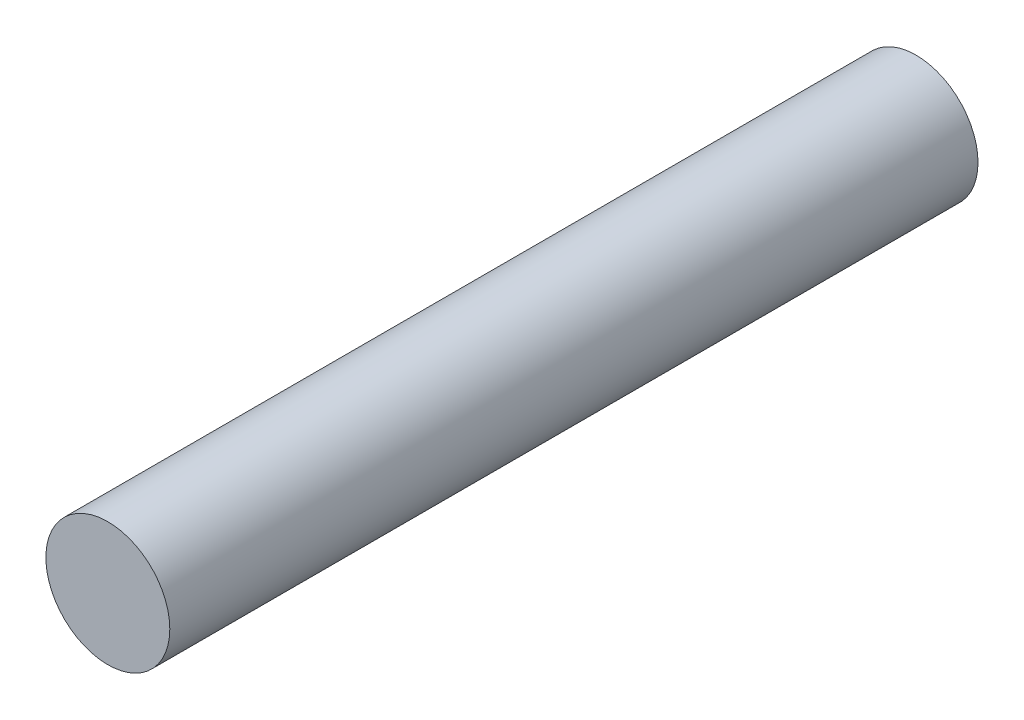
ISO-10303-21;
HEADER;
FILE_DESCRIPTION(('STEP AP214'),'2;1');
FILE_NAME('part.step','',(''),(''),'','','');
FILE_SCHEMA(('AUTOMOTIVE_DESIGN { 1 0 10303 214 1 1 1 1 }'));
ENDSEC;
DATA;
#1=APPLICATION_CONTEXT('core data for automotive mechanical design processes');
#2=APPLICATION_PROTOCOL_DEFINITION('international standard','automotive_design',2000,#1);
#3=PRODUCT_CONTEXT('',#1,'mechanical');
#4=PRODUCT('Part','Part','',(#3));
#5=PRODUCT_RELATED_PRODUCT_CATEGORY('part','',(#4));
#6=PRODUCT_DEFINITION_FORMATION('','',#4);
#7=PRODUCT_DEFINITION_CONTEXT('part definition',#1,'design');
#8=PRODUCT_DEFINITION('design','',#6,#7);
#9=PRODUCT_DEFINITION_SHAPE('','',#8);
#10=(LENGTH_UNIT() NAMED_UNIT(*) SI_UNIT(.MILLI.,.METRE.));
#11=(NAMED_UNIT(*) PLANE_ANGLE_UNIT() SI_UNIT($,.RADIAN.));
#12=(NAMED_UNIT(*) SI_UNIT($,.STERADIAN.) SOLID_ANGLE_UNIT());
#13=UNCERTAINTY_MEASURE_WITH_UNIT(LENGTH_MEASURE(1.E-05),#10,'distance_accuracy_value','');
#14=(GEOMETRIC_REPRESENTATION_CONTEXT(3) GLOBAL_UNCERTAINTY_ASSIGNED_CONTEXT((#13)) GLOBAL_UNIT_ASSIGNED_CONTEXT((#10,
#11,#12)) REPRESENTATION_CONTEXT('',''));
#15=CARTESIAN_POINT('',(0.,0.,0.));
#16=DIRECTION('',(0.,0.,1.));
#17=DIRECTION('',(1.,0.,0.));
#18=AXIS2_PLACEMENT_3D('',#15,#16,#17);
#19=CARTESIAN_POINT('',(0.,0.,19.05));
#20=DIRECTION('',(0.,0.,-1.));
#21=DIRECTION('',(-1.,0.,0.));
#22=AXIS2_PLACEMENT_3D('',#19,#20,#21);
#23=CYLINDRICAL_SURFACE('',#22,1.4605);
#24=CARTESIAN_POINT('',(0.,0.,19.05));
#25=DIRECTION('',(0.,0.,1.));
#26=DIRECTION('',(1.,0.,0.));
#27=AXIS2_PLACEMENT_3D('',#24,#25,#26);
#28=CIRCLE('',#27,1.4605);
#29=CARTESIAN_POINT('',(1.4605,0.,19.05));
#30=VERTEX_POINT('',#29);
#31=EDGE_CURVE('E10',#30,#30,#28,.T.);
#32=ORIENTED_EDGE('',*,*,#31,.F.);
#33=EDGE_LOOP('',(#32));
#34=FACE_BOUND('',#33,.T.);
#35=CARTESIAN_POINT('',(0.,0.,0.));
#36=DIRECTION('',(0.,0.,1.));
#37=DIRECTION('',(1.,0.,0.));
#38=AXIS2_PLACEMENT_3D('',#35,#36,#37);
#39=CIRCLE('',#38,1.4605);
#40=CARTESIAN_POINT('',(1.4605,0.,0.));
#41=VERTEX_POINT('',#40);
#42=EDGE_CURVE('E40',#41,#41,#39,.T.);
#43=ORIENTED_EDGE('',*,*,#42,.T.);
#44=EDGE_LOOP('',(#43));
#45=FACE_BOUND('',#44,.T.);
#46=ADVANCED_FACE('F37',(#34,#45),#23,.T.);
#47=CARTESIAN_POINT('',(0.,0.,19.05));
#48=DIRECTION('',(0.,0.,1.));
#49=DIRECTION('',(1.,0.,0.));
#50=AXIS2_PLACEMENT_3D('',#47,#48,#49);
#51=PLANE('',#50);
#52=ORIENTED_EDGE('',*,*,#31,.T.);
#53=EDGE_LOOP('',(#52));
#54=FACE_BOUND('',#53,.T.);
#55=ADVANCED_FACE('F52',(#54),#51,.T.);
#56=CARTESIAN_POINT('',(0.,0.,0.));
#57=DIRECTION('',(0.,0.,1.));
#58=DIRECTION('',(1.,0.,0.));
#59=AXIS2_PLACEMENT_3D('',#56,#57,#58);
#60=PLANE('',#59);
#61=ORIENTED_EDGE('',*,*,#42,.F.);
#62=EDGE_LOOP('',(#61));
#63=FACE_BOUND('',#62,.T.);
#64=ADVANCED_FACE('F50',(#63),#60,.F.);
#65=CLOSED_SHELL('',(#46,#55,#64));
#66=MANIFOLD_SOLID_BREP('B2',#65);
#67=ADVANCED_BREP_SHAPE_REPRESENTATION('',(#18,#66),#14);
#68=SHAPE_DEFINITION_REPRESENTATION(#9,#67);
ENDSEC;
END-ISO-10303-21;
